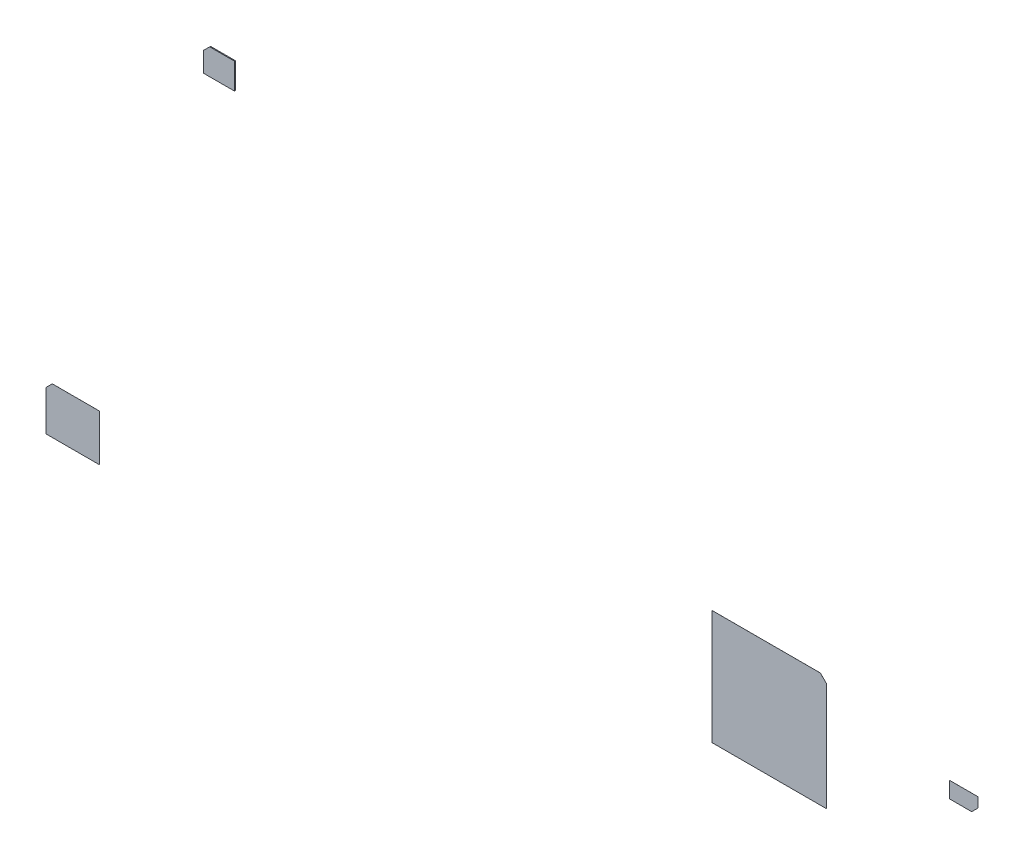
ISO-10303-21;
HEADER;
FILE_DESCRIPTION(('STEP AP214'),'2;1');
FILE_NAME('part.step','',(''),(''),'','','');
FILE_SCHEMA(('AUTOMOTIVE_DESIGN { 1 0 10303 214 1 1 1 1 }'));
ENDSEC;
DATA;
#1=APPLICATION_CONTEXT('core data for automotive mechanical design processes');
#2=APPLICATION_PROTOCOL_DEFINITION('international standard','automotive_design',2000,#1);
#3=PRODUCT_CONTEXT('',#1,'mechanical');
#4=PRODUCT('Part','Part','',(#3));
#5=PRODUCT_RELATED_PRODUCT_CATEGORY('part','',(#4));
#6=PRODUCT_DEFINITION_FORMATION('','',#4);
#7=PRODUCT_DEFINITION_CONTEXT('part definition',#1,'design');
#8=PRODUCT_DEFINITION('design','',#6,#7);
#9=PRODUCT_DEFINITION_SHAPE('','',#8);
#10=(LENGTH_UNIT() NAMED_UNIT(*) SI_UNIT(.MILLI.,.METRE.));
#11=(NAMED_UNIT(*) PLANE_ANGLE_UNIT() SI_UNIT($,.RADIAN.));
#12=(NAMED_UNIT(*) SI_UNIT($,.STERADIAN.) SOLID_ANGLE_UNIT());
#13=UNCERTAINTY_MEASURE_WITH_UNIT(LENGTH_MEASURE(1.E-05),#10,'distance_accuracy_value','');
#14=(GEOMETRIC_REPRESENTATION_CONTEXT(3) GLOBAL_UNCERTAINTY_ASSIGNED_CONTEXT((#13)) GLOBAL_UNIT_ASSIGNED_CONTEXT((#10,
#11,#12)) REPRESENTATION_CONTEXT('',''));
#15=CARTESIAN_POINT('',(0.,0.,0.));
#16=DIRECTION('',(0.,0.,1.));
#17=DIRECTION('',(1.,0.,0.));
#18=AXIS2_PLACEMENT_3D('',#15,#16,#17);
#19=CARTESIAN_POINT('',(-23.5424431925275,-0.652606286569893,1.1503905579871E-06));
#20=DIRECTION('',(0.,-8.74227339409094E-08,1.));
#21=DIRECTION('',(4.37113882867396E-08,1.,8.74227339409093E-08));
#22=AXIS2_PLACEMENT_3D('',#19,#20,#21);
#23=PLANE('',#22);
#24=DIRECTION('',(-4.37113882867396E-08,-1.,-8.74227339409093E-08));
#25=VECTOR('',#24,1.);
#26=CARTESIAN_POINT('',(-23.5424431925275,-0.652606286569893,1.1503905579871E-06));
#27=LINE('',#26,#25);
#28=CARTESIAN_POINT('',(-23.5424431925275,-0.652606286569893,1.1503905579871E-06));
#29=VERTEX_POINT('',#28);
#30=CARTESIAN_POINT('',(-23.542443306177,-3.25260628656988,9.23091450066166E-07));
#31=VERTEX_POINT('',#30);
#32=EDGE_CURVE('P0_E87',#29,#31,#27,.T.);
#33=ORIENTED_EDGE('',*,*,#32,.T.);
#34=DIRECTION('',(-1.,4.37113882867395E-08,0.));
#35=VECTOR('',#34,1.);
#36=CARTESIAN_POINT('',(-23.542443306177,-3.25260628656988,9.23091450066166E-07));
#37=LINE('',#36,#35);
#38=CARTESIAN_POINT('',(-26.542443306177,-3.25260615543571,9.23091461341868E-07));
#39=VERTEX_POINT('',#38);
#40=EDGE_CURVE('P0_E111',#31,#39,#37,.T.);
#41=ORIENTED_EDGE('',*,*,#40,.T.);
#42=DIRECTION('',(4.37113882867396E-08,1.,8.74227339409093E-08));
#43=VECTOR('',#42,1.);
#44=CARTESIAN_POINT('',(-26.542443306177,-3.25260615543571,9.23091461341868E-07));
#45=LINE('',#44,#43);
#46=CARTESIAN_POINT('',(-26.5424432078265,-1.00260615543572,1.11979261280259E-06));
#47=VERTEX_POINT('',#46);
#48=EDGE_CURVE('P0_E119',#39,#47,#45,.T.);
#49=ORIENTED_EDGE('',*,*,#48,.T.);
#50=DIRECTION('',(0.707106812095165,0.707106750277927,6.18172052973683E-08));
#51=VECTOR('',#50,1.);
#52=CARTESIAN_POINT('',(-26.5424432078265,-1.00260615543572,1.11979261280259E-06));
#53=LINE('',#52,#51);
#54=CARTESIAN_POINT('',(-26.1924431925275,-0.652606170734704,1.15039056839544E-06));
#55=VERTEX_POINT('',#54);
#56=EDGE_CURVE('P0_E79',#47,#55,#53,.T.);
#57=ORIENTED_EDGE('',*,*,#56,.T.);
#58=DIRECTION('',(1.,-4.37113882867395E-08,0.));
#59=VECTOR('',#58,1.);
#60=CARTESIAN_POINT('',(-26.1924431925275,-0.652606170734704,1.15039056839544E-06));
#61=LINE('',#60,#59);
#62=EDGE_CURVE('P0_E11',#55,#29,#61,.T.);
#63=ORIENTED_EDGE('',*,*,#62,.T.);
#64=EDGE_LOOP('',(#33,#41,#49,#57,#63));
#65=FACE_BOUND('',#64,.T.);
#66=ADVANCED_FACE('P0_F17',(#65),#23,.F.);
#67=CARTESIAN_POINT('',(-23.5424431925275,-0.652606286657309,0.00100115039055812));
#68=DIRECTION('',(0.,-8.74227339409094E-08,1.));
#69=DIRECTION('',(4.37113882867396E-08,1.,8.74227339409093E-08));
#70=AXIS2_PLACEMENT_3D('',#67,#68,#69);
#71=PLANE('',#70);
#72=DIRECTION('',(1.,-4.37113882867395E-08,0.));
#73=VECTOR('',#72,1.);
#74=CARTESIAN_POINT('',(-26.1924431925275,-0.652606170822134,0.00100115039056809));
#75=LINE('',#74,#73);
#76=CARTESIAN_POINT('',(-26.1924431925275,-0.652606170822134,0.00100115039056809));
#77=VERTEX_POINT('',#76);
#78=CARTESIAN_POINT('',(-23.5424431925275,-0.652606286657309,0.00100115039055812));
#79=VERTEX_POINT('',#78);
#80=EDGE_CURVE('P0_E27',#77,#79,#75,.T.);
#81=ORIENTED_EDGE('',*,*,#80,.F.);
#82=DIRECTION('',(0.707106812095165,0.707106750277927,6.18172052973683E-08));
#83=VECTOR('',#82,1.);
#84=CARTESIAN_POINT('',(-26.5424432078265,-1.00260615552314,0.0010011197926125));
#85=LINE('',#84,#83);
#86=CARTESIAN_POINT('',(-26.5424432078265,-1.00260615552314,0.0010011197926125));
#87=VERTEX_POINT('',#86);
#88=EDGE_CURVE('P0_E123',#87,#77,#85,.T.);
#89=ORIENTED_EDGE('',*,*,#88,.F.);
#90=DIRECTION('',(4.37113882867396E-08,1.,8.74227339409093E-08));
#91=VECTOR('',#90,1.);
#92=CARTESIAN_POINT('',(-26.542443306177,-3.25260615552314,0.00100092309146147));
#93=LINE('',#92,#91);
#94=CARTESIAN_POINT('',(-26.542443306177,-3.25260615552314,0.00100092309146147));
#95=VERTEX_POINT('',#94);
#96=EDGE_CURVE('P0_E115',#95,#87,#93,.T.);
#97=ORIENTED_EDGE('',*,*,#96,.F.);
#98=DIRECTION('',(-1.,4.37113882867395E-08,0.));
#99=VECTOR('',#98,1.);
#100=CARTESIAN_POINT('',(-23.542443306177,-3.2526062866573,0.00100092309144976));
#101=LINE('',#100,#99);
#102=CARTESIAN_POINT('',(-23.542443306177,-3.2526062866573,0.00100092309144976));
#103=VERTEX_POINT('',#102);
#104=EDGE_CURVE('P0_E89',#103,#95,#101,.T.);
#105=ORIENTED_EDGE('',*,*,#104,.F.);
#106=DIRECTION('',(-4.37113882867396E-08,-1.,-8.74227339409093E-08));
#107=VECTOR('',#106,1.);
#108=CARTESIAN_POINT('',(-23.5424431925275,-0.652606286657309,0.00100115039055812));
#109=LINE('',#108,#107);
#110=EDGE_CURVE('P0_E85',#79,#103,#109,.T.);
#111=ORIENTED_EDGE('',*,*,#110,.F.);
#112=EDGE_LOOP('',(#81,#89,#97,#105,#111));
#113=FACE_BOUND('',#112,.T.);
#114=ADVANCED_FACE('P0_F91',(#113),#71,.T.);
#115=CARTESIAN_POINT('',(-26.1924431925275,-0.652606170822134,0.00100115039056809));
#116=DIRECTION('',(-4.37113882867396E-08,-1.,-8.74227339409093E-08));
#117=DIRECTION('',(1.,-4.37113882867395E-08,0.));
#118=AXIS2_PLACEMENT_3D('',#115,#116,#117);
#119=PLANE('',#118);
#120=ORIENTED_EDGE('',*,*,#80,.T.);
#121=DIRECTION('',(0.,8.74227339409094E-08,-1.));
#122=VECTOR('',#121,1.);
#123=CARTESIAN_POINT('',(-23.5424431925275,-0.652606286657309,0.00100115039055812));
#124=LINE('',#123,#122);
#125=EDGE_CURVE('P0_E71',#79,#29,#124,.T.);
#126=ORIENTED_EDGE('',*,*,#125,.T.);
#127=ORIENTED_EDGE('',*,*,#62,.F.);
#128=DIRECTION('',(0.,8.74227339409094E-08,-1.));
#129=VECTOR('',#128,1.);
#130=CARTESIAN_POINT('',(-26.1924431925275,-0.652606170822134,0.00100115039056809));
#131=LINE('',#130,#129);
#132=EDGE_CURVE('P0_E74',#77,#55,#131,.T.);
#133=ORIENTED_EDGE('',*,*,#132,.F.);
#134=EDGE_LOOP('',(#120,#126,#127,#133));
#135=FACE_BOUND('',#134,.T.);
#136=ADVANCED_FACE('P0_F70',(#135),#119,.F.);
#137=CARTESIAN_POINT('',(-26.5424432078265,-1.00260615552314,0.0010011197926125));
#138=DIRECTION('',(0.707106750277927,-0.707106812095165,-6.18172107016005E-08));
#139=DIRECTION('',(0.707106812095165,0.707106750277927,6.18172052973683E-08));
#140=AXIS2_PLACEMENT_3D('',#137,#138,#139);
#141=PLANE('',#140);
#142=ORIENTED_EDGE('',*,*,#88,.T.);
#143=ORIENTED_EDGE('',*,*,#132,.T.);
#144=ORIENTED_EDGE('',*,*,#56,.F.);
#145=DIRECTION('',(0.,8.74227339409094E-08,-1.));
#146=VECTOR('',#145,1.);
#147=CARTESIAN_POINT('',(-26.5424432078265,-1.00260615552314,0.0010011197926125));
#148=LINE('',#147,#146);
#149=EDGE_CURVE('P0_E124',#87,#47,#148,.T.);
#150=ORIENTED_EDGE('',*,*,#149,.F.);
#151=EDGE_LOOP('',(#142,#143,#144,#150));
#152=FACE_BOUND('',#151,.T.);
#153=ADVANCED_FACE('P0_F172',(#152),#141,.F.);
#154=CARTESIAN_POINT('',(-26.542443306177,-3.25260615552314,0.00100092309146147));
#155=DIRECTION('',(1.,-4.37113882867395E-08,0.));
#156=DIRECTION('',(4.37113882867396E-08,1.,8.74227339409093E-08));
#157=AXIS2_PLACEMENT_3D('',#154,#155,#156);
#158=PLANE('',#157);
#159=ORIENTED_EDGE('',*,*,#96,.T.);
#160=ORIENTED_EDGE('',*,*,#149,.T.);
#161=ORIENTED_EDGE('',*,*,#48,.F.);
#162=DIRECTION('',(0.,8.74227339409094E-08,-1.));
#163=VECTOR('',#162,1.);
#164=CARTESIAN_POINT('',(-26.542443306177,-3.25260615552314,0.00100092309146147));
#165=LINE('',#164,#163);
#166=EDGE_CURVE('P0_E116',#95,#39,#165,.T.);
#167=ORIENTED_EDGE('',*,*,#166,.F.);
#168=EDGE_LOOP('',(#159,#160,#161,#167));
#169=FACE_BOUND('',#168,.T.);
#170=ADVANCED_FACE('P0_F171',(#169),#158,.F.);
#171=CARTESIAN_POINT('',(-23.542443306177,-3.2526062866573,0.00100092309144976));
#172=DIRECTION('',(4.37113882867396E-08,1.,8.74227339409093E-08));
#173=DIRECTION('',(-1.,4.37113882867395E-08,0.));
#174=AXIS2_PLACEMENT_3D('',#171,#172,#173);
#175=PLANE('',#174);
#176=ORIENTED_EDGE('',*,*,#104,.T.);
#177=ORIENTED_EDGE('',*,*,#166,.T.);
#178=ORIENTED_EDGE('',*,*,#40,.F.);
#179=DIRECTION('',(0.,8.74227339409094E-08,-1.));
#180=VECTOR('',#179,1.);
#181=CARTESIAN_POINT('',(-23.542443306177,-3.2526062866573,0.00100092309144976));
#182=LINE('',#181,#180);
#183=EDGE_CURVE('P0_E95',#103,#31,#182,.T.);
#184=ORIENTED_EDGE('',*,*,#183,.F.);
#185=EDGE_LOOP('',(#176,#177,#178,#184));
#186=FACE_BOUND('',#185,.T.);
#187=ADVANCED_FACE('P0_F173',(#186),#175,.F.);
#188=CARTESIAN_POINT('',(-23.5424431925275,-0.652606286657309,0.00100115039055812));
#189=DIRECTION('',(-1.,4.37113882867395E-08,0.));
#190=DIRECTION('',(-4.37113882867396E-08,-1.,-8.74227339409093E-08));
#191=AXIS2_PLACEMENT_3D('',#188,#189,#190);
#192=PLANE('',#191);
#193=ORIENTED_EDGE('',*,*,#110,.T.);
#194=ORIENTED_EDGE('',*,*,#183,.T.);
#195=ORIENTED_EDGE('',*,*,#32,.F.);
#196=ORIENTED_EDGE('',*,*,#125,.F.);
#197=EDGE_LOOP('',(#193,#194,#195,#196));
#198=FACE_BOUND('',#197,.T.);
#199=ADVANCED_FACE('P0_F83',(#198),#192,.F.);
#200=CLOSED_SHELL('',(#66,#114,#136,#153,#170,#187,#199));
#201=MANIFOLD_SOLID_BREP('P0_B1',#200);
#202=CARTESIAN_POINT('',(-16.0071981615115,20.0559707106793,-0.0499988998775109));
#203=DIRECTION('',(0.,-8.74227339409094E-08,1.));
#204=DIRECTION('',(4.37113882867396E-08,1.,8.74227339409093E-08));
#205=AXIS2_PLACEMENT_3D('',#202,#203,#204);
#206=PLANE('',#205);
#207=DIRECTION('',(-4.37113882867396E-08,-1.,-8.74227339409093E-08));
#208=VECTOR('',#207,1.);
#209=CARTESIAN_POINT('',(-16.0071981615115,20.0559707106793,-0.0499988998775109));
#210=LINE('',#209,#208);
#211=CARTESIAN_POINT('',(-16.0071981615115,20.0559707106793,-0.0499988998775109));
#212=VERTEX_POINT('',#211);
#213=CARTESIAN_POINT('',(-16.0071982248931,18.6059707106793,-0.0499990266404752));
#214=VERTEX_POINT('',#213);
#215=EDGE_CURVE('P1_E97',#212,#214,#210,.T.);
#216=ORIENTED_EDGE('',*,*,#215,.T.);
#217=DIRECTION('',(-1.,4.37113882867395E-08,0.));
#218=VECTOR('',#217,1.);
#219=CARTESIAN_POINT('',(-16.0071982248931,18.6059707106793,-0.0499990266404752));
#220=LINE('',#219,#218);
#221=CARTESIAN_POINT('',(-17.7471982248931,18.6059707867372,-0.0499990266404687));
#222=VERTEX_POINT('',#221);
#223=EDGE_CURVE('P1_E92',#214,#222,#220,.T.);
#224=ORIENTED_EDGE('',*,*,#223,.T.);
#225=DIRECTION('',(4.37113882867396E-08,1.,8.74227339409093E-08));
#226=VECTOR('',#225,1.);
#227=CARTESIAN_POINT('',(-17.7471982248931,18.6059707867372,-0.0499990266404687));
#228=LINE('',#227,#226);
#229=CARTESIAN_POINT('',(-17.7471981768105,19.7059707867371,-0.0499989304754613));
#230=VERTEX_POINT('',#229);
#231=EDGE_CURVE('P1_E118',#222,#230,#228,.T.);
#232=ORIENTED_EDGE('',*,*,#231,.T.);
#233=DIRECTION('',(0.707106812095165,0.707106750277927,6.18172052973683E-08));
#234=VECTOR('',#233,1.);
#235=CARTESIAN_POINT('',(-17.7471981768105,19.7059707867371,-0.0499989304754613));
#236=LINE('',#235,#234);
#237=CARTESIAN_POINT('',(-17.3971981615116,20.0559707714382,-0.0499988998775057));
#238=VERTEX_POINT('',#237);
#239=EDGE_CURVE('P1_E126',#230,#238,#236,.T.);
#240=ORIENTED_EDGE('',*,*,#239,.T.);
#241=DIRECTION('',(1.,-4.37113882867395E-08,0.));
#242=VECTOR('',#241,1.);
#243=CARTESIAN_POINT('',(-17.3971981615116,20.0559707714382,-0.0499988998775057));
#244=LINE('',#243,#242);
#245=EDGE_CURVE('P1_E11',#238,#212,#244,.T.);
#246=ORIENTED_EDGE('',*,*,#245,.T.);
#247=EDGE_LOOP('',(#216,#224,#232,#240,#246));
#248=FACE_BOUND('',#247,.T.);
#249=ADVANCED_FACE('P1_F17',(#248),#206,.F.);
#250=CARTESIAN_POINT('',(-16.0071981615115,20.0559707063082,1.10012248876606E-06));
#251=DIRECTION('',(0.,-8.74227339409094E-08,1.));
#252=DIRECTION('',(4.37113882867396E-08,1.,8.74227339409093E-08));
#253=AXIS2_PLACEMENT_3D('',#250,#251,#252);
#254=PLANE('',#253);
#255=DIRECTION('',(1.,-4.37113882867395E-08,0.));
#256=VECTOR('',#255,1.);
#257=CARTESIAN_POINT('',(-17.3971981615116,20.055970767067,1.10012249397023E-06));
#258=LINE('',#257,#256);
#259=CARTESIAN_POINT('',(-17.3971981615116,20.055970767067,1.10012249397023E-06));
#260=VERTEX_POINT('',#259);
#261=CARTESIAN_POINT('',(-16.0071981615115,20.0559707063082,1.10012248876606E-06));
#262=VERTEX_POINT('',#261);
#263=EDGE_CURVE('P1_E26',#260,#262,#258,.T.);
#264=ORIENTED_EDGE('',*,*,#263,.F.);
#265=DIRECTION('',(0.707106812095165,0.707106750277927,6.18172052973683E-08));
#266=VECTOR('',#265,1.);
#267=CARTESIAN_POINT('',(-17.7471981768105,19.705970782366,1.06952453837739E-06));
#268=LINE('',#267,#266);
#269=CARTESIAN_POINT('',(-17.7471981768105,19.705970782366,1.06952453837739E-06));
#270=VERTEX_POINT('',#269);
#271=EDGE_CURVE('P1_E122',#270,#260,#268,.T.);
#272=ORIENTED_EDGE('',*,*,#271,.F.);
#273=DIRECTION('',(4.37113882867396E-08,1.,8.74227339409093E-08));
#274=VECTOR('',#273,1.);
#275=CARTESIAN_POINT('',(-17.7471982248931,18.6059707823661,9.73359530996587E-07));
#276=LINE('',#275,#274);
#277=CARTESIAN_POINT('',(-17.7471982248931,18.6059707823661,9.73359530996587E-07));
#278=VERTEX_POINT('',#277);
#279=EDGE_CURVE('P1_E80',#278,#270,#276,.T.);
#280=ORIENTED_EDGE('',*,*,#279,.F.);
#281=DIRECTION('',(-1.,4.37113882867395E-08,0.));
#282=VECTOR('',#281,1.);
#283=CARTESIAN_POINT('',(-16.0071982248931,18.6059707063082,9.73359524491374E-07));
#284=LINE('',#283,#282);
#285=CARTESIAN_POINT('',(-16.0071982248931,18.6059707063082,9.73359524491374E-07));
#286=VERTEX_POINT('',#285);
#287=EDGE_CURVE('P1_E74',#286,#278,#284,.T.);
#288=ORIENTED_EDGE('',*,*,#287,.F.);
#289=DIRECTION('',(-4.37113882867396E-08,-1.,-8.74227339409093E-08));
#290=VECTOR('',#289,1.);
#291=CARTESIAN_POINT('',(-16.0071981615115,20.0559707063082,1.10012248876606E-06));
#292=LINE('',#291,#290);
#293=EDGE_CURVE('P1_E78',#262,#286,#292,.T.);
#294=ORIENTED_EDGE('',*,*,#293,.F.);
#295=EDGE_LOOP('',(#264,#272,#280,#288,#294));
#296=FACE_BOUND('',#295,.T.);
#297=ADVANCED_FACE('P1_F76',(#296),#254,.T.);
#298=CARTESIAN_POINT('',(-17.3971981615116,20.055970767067,1.10012249397023E-06));
#299=DIRECTION('',(-4.37113882867396E-08,-1.,-8.74227339409093E-08));
#300=DIRECTION('',(1.,-4.37113882867395E-08,0.));
#301=AXIS2_PLACEMENT_3D('',#298,#299,#300);
#302=PLANE('',#301);
#303=ORIENTED_EDGE('',*,*,#263,.T.);
#304=DIRECTION('',(0.,8.74227339409094E-08,-1.));
#305=VECTOR('',#304,1.);
#306=CARTESIAN_POINT('',(-16.0071981615115,20.0559707063082,1.10012248876606E-06));
#307=LINE('',#306,#305);
#308=EDGE_CURVE('P1_E86',#262,#212,#307,.T.);
#309=ORIENTED_EDGE('',*,*,#308,.T.);
#310=ORIENTED_EDGE('',*,*,#245,.F.);
#311=DIRECTION('',(0.,8.74227339409094E-08,-1.));
#312=VECTOR('',#311,1.);
#313=CARTESIAN_POINT('',(-17.3971981615116,20.055970767067,1.10012249397023E-06));
#314=LINE('',#313,#312);
#315=EDGE_CURVE('P1_E129',#260,#238,#314,.T.);
#316=ORIENTED_EDGE('',*,*,#315,.F.);
#317=EDGE_LOOP('',(#303,#309,#310,#316));
#318=FACE_BOUND('',#317,.T.);
#319=ADVANCED_FACE('P1_F170',(#318),#302,.F.);
#320=CARTESIAN_POINT('',(-17.7471981768105,19.705970782366,1.06952453837739E-06));
#321=DIRECTION('',(0.707106750277927,-0.707106812095165,-6.18172107016005E-08));
#322=DIRECTION('',(0.707106812095165,0.707106750277927,6.18172052973683E-08));
#323=AXIS2_PLACEMENT_3D('',#320,#321,#322);
#324=PLANE('',#323);
#325=ORIENTED_EDGE('',*,*,#271,.T.);
#326=ORIENTED_EDGE('',*,*,#315,.T.);
#327=ORIENTED_EDGE('',*,*,#239,.F.);
#328=DIRECTION('',(0.,8.74227339409094E-08,-1.));
#329=VECTOR('',#328,1.);
#330=CARTESIAN_POINT('',(-17.7471981768105,19.705970782366,1.06952453837739E-06));
#331=LINE('',#330,#329);
#332=EDGE_CURVE('P1_E123',#270,#230,#331,.T.);
#333=ORIENTED_EDGE('',*,*,#332,.F.);
#334=EDGE_LOOP('',(#325,#326,#327,#333));
#335=FACE_BOUND('',#334,.T.);
#336=ADVANCED_FACE('P1_F181',(#335),#324,.F.);
#337=CARTESIAN_POINT('',(-17.7471982248931,18.6059707823661,9.73359530996587E-07));
#338=DIRECTION('',(1.,-4.37113882867395E-08,0.));
#339=DIRECTION('',(4.37113882867396E-08,1.,8.74227339409093E-08));
#340=AXIS2_PLACEMENT_3D('',#337,#338,#339);
#341=PLANE('',#340);
#342=ORIENTED_EDGE('',*,*,#279,.T.);
#343=ORIENTED_EDGE('',*,*,#332,.T.);
#344=ORIENTED_EDGE('',*,*,#231,.F.);
#345=DIRECTION('',(0.,8.74227339409094E-08,-1.));
#346=VECTOR('',#345,1.);
#347=CARTESIAN_POINT('',(-17.7471982248931,18.6059707823661,9.73359530996587E-07));
#348=LINE('',#347,#346);
#349=EDGE_CURVE('P1_E85',#278,#222,#348,.T.);
#350=ORIENTED_EDGE('',*,*,#349,.F.);
#351=EDGE_LOOP('',(#342,#343,#344,#350));
#352=FACE_BOUND('',#351,.T.);
#353=ADVANCED_FACE('P1_F179',(#352),#341,.F.);
#354=CARTESIAN_POINT('',(-16.0071982248931,18.6059707063082,9.73359524491374E-07));
#355=DIRECTION('',(4.37113882867396E-08,1.,8.74227339409093E-08));
#356=DIRECTION('',(-1.,4.37113882867395E-08,0.));
#357=AXIS2_PLACEMENT_3D('',#354,#355,#356);
#358=PLANE('',#357);
#359=ORIENTED_EDGE('',*,*,#287,.T.);
#360=ORIENTED_EDGE('',*,*,#349,.T.);
#361=ORIENTED_EDGE('',*,*,#223,.F.);
#362=DIRECTION('',(0.,8.74227339409094E-08,-1.));
#363=VECTOR('',#362,1.);
#364=CARTESIAN_POINT('',(-16.0071982248931,18.6059707063082,9.73359524491374E-07));
#365=LINE('',#364,#363);
#366=EDGE_CURVE('P1_E89',#286,#214,#365,.T.);
#367=ORIENTED_EDGE('',*,*,#366,.F.);
#368=EDGE_LOOP('',(#359,#360,#361,#367));
#369=FACE_BOUND('',#368,.T.);
#370=ADVANCED_FACE('P1_F90',(#369),#358,.F.);
#371=CARTESIAN_POINT('',(-16.0071981615115,20.0559707063082,1.10012248876606E-06));
#372=DIRECTION('',(-1.,4.37113882867395E-08,0.));
#373=DIRECTION('',(-4.37113882867396E-08,-1.,-8.74227339409093E-08));
#374=AXIS2_PLACEMENT_3D('',#371,#372,#373);
#375=PLANE('',#374);
#376=ORIENTED_EDGE('',*,*,#293,.T.);
#377=ORIENTED_EDGE('',*,*,#366,.T.);
#378=ORIENTED_EDGE('',*,*,#215,.F.);
#379=ORIENTED_EDGE('',*,*,#308,.F.);
#380=EDGE_LOOP('',(#376,#377,#378,#379));
#381=FACE_BOUND('',#380,.T.);
#382=ADVANCED_FACE('P1_F100',(#381),#375,.F.);
#383=CLOSED_SHELL('',(#249,#297,#319,#336,#353,#370,#382));
#384=MANIFOLD_SOLID_BREP('P1_B1',#383);
#385=CARTESIAN_POINT('',(17.0861605968744,0.415760503644086,7.56988240754181E-07));
#386=DIRECTION('',(0.,-8.74227339409092E-08,1.));
#387=DIRECTION('',(1.,-8.74227765734792E-08,0.));
#388=AXIS2_PLACEMENT_3D('',#385,#386,#387);
#389=PLANE('',#388);
#390=DIRECTION('',(-1.,8.74227765734792E-08,0.));
#391=VECTOR('',#390,1.);
#392=CARTESIAN_POINT('',(17.0861605968744,0.415760503644086,7.56988240754181E-07));
#393=LINE('',#392,#391);
#394=CARTESIAN_POINT('',(17.0861605968744,0.415760503644086,7.56988240754181E-07));
#395=VERTEX_POINT('',#394);
#396=CARTESIAN_POINT('',(10.6861605968744,0.415761063149861,7.56988289760119E-07));
#397=VERTEX_POINT('',#396);
#398=EDGE_CURVE('P2_E87',#395,#397,#393,.T.);
#399=ORIENTED_EDGE('',*,*,#398,.T.);
#400=DIRECTION('',(8.74227765734795E-08,1.,8.74227339409088E-08));
#401=VECTOR('',#400,1.);
#402=CARTESIAN_POINT('',(10.6861605968744,0.415761063149861,7.56988289760119E-07));
#403=LINE('',#402,#401);
#404=CARTESIAN_POINT('',(10.6861611563802,6.81576106314982,1.31649378681473E-06));
#405=VERTEX_POINT('',#404);
#406=EDGE_CURVE('P2_E111',#397,#405,#403,.T.);
#407=ORIENTED_EDGE('',*,*,#406,.T.);
#408=DIRECTION('',(1.,-8.74227765734792E-08,0.));
#409=VECTOR('',#408,1.);
#410=CARTESIAN_POINT('',(10.6861611563802,6.81576106314982,1.31649378681473E-06));
#411=LINE('',#410,#409);
#412=CARTESIAN_POINT('',(16.7361611563802,6.81576053424202,1.31649374084455E-06));
#413=VERTEX_POINT('',#412);
#414=EDGE_CURVE('P2_E119',#405,#413,#411,.T.);
#415=ORIENTED_EDGE('',*,*,#414,.T.);
#416=DIRECTION('',(0.707106719369306,-0.707106843003783,-6.18172134037162E-08));
#417=VECTOR('',#416,1.);
#418=CARTESIAN_POINT('',(16.7361611563802,6.81576053424202,1.31649374084455E-06));
#419=LINE('',#418,#417);
#420=CARTESIAN_POINT('',(17.0861611257822,6.46576050364406,1.28589578134858E-06));
#421=VERTEX_POINT('',#420);
#422=EDGE_CURVE('P2_E79',#413,#421,#419,.T.);
#423=ORIENTED_EDGE('',*,*,#422,.T.);
#424=DIRECTION('',(-8.74227765734795E-08,-1.,-8.74227339409088E-08));
#425=VECTOR('',#424,1.);
#426=CARTESIAN_POINT('',(17.0861611257822,6.46576050364406,1.28589578134858E-06));
#427=LINE('',#426,#425);
#428=EDGE_CURVE('P2_E11',#421,#395,#427,.T.);
#429=ORIENTED_EDGE('',*,*,#428,.T.);
#430=EDGE_LOOP('',(#399,#407,#415,#423,#429));
#431=FACE_BOUND('',#430,.T.);
#432=ADVANCED_FACE('P2_F17',(#431),#389,.F.);
#433=CARTESIAN_POINT('',(17.0861605968744,0.415760503556656,0.00100075698824089));
#434=DIRECTION('',(0.,-8.74227339409092E-08,1.));
#435=DIRECTION('',(1.,-8.74227765734792E-08,0.));
#436=AXIS2_PLACEMENT_3D('',#433,#434,#435);
#437=PLANE('',#436);
#438=DIRECTION('',(-8.74227765734795E-08,-1.,-8.74227339409088E-08));
#439=VECTOR('',#438,1.);
#440=CARTESIAN_POINT('',(17.0861611257822,6.46576050355663,0.00100128589578105));
#441=LINE('',#440,#439);
#442=CARTESIAN_POINT('',(17.0861611257822,6.46576050355663,0.00100128589578105));
#443=VERTEX_POINT('',#442);
#444=CARTESIAN_POINT('',(17.0861605968744,0.415760503556656,0.00100075698824089));
#445=VERTEX_POINT('',#444);
#446=EDGE_CURVE('P2_E27',#443,#445,#441,.T.);
#447=ORIENTED_EDGE('',*,*,#446,.F.);
#448=DIRECTION('',(0.707106719369306,-0.707106843003783,-6.18172134037162E-08));
#449=VECTOR('',#448,1.);
#450=CARTESIAN_POINT('',(16.7361611563802,6.81576053415459,0.00100131649374098));
#451=LINE('',#450,#449);
#452=CARTESIAN_POINT('',(16.7361611563802,6.81576053415459,0.00100131649374098));
#453=VERTEX_POINT('',#452);
#454=EDGE_CURVE('P2_E123',#453,#443,#451,.T.);
#455=ORIENTED_EDGE('',*,*,#454,.F.);
#456=DIRECTION('',(1.,-8.74227765734792E-08,0.));
#457=VECTOR('',#456,1.);
#458=CARTESIAN_POINT('',(10.6861611563802,6.81576106306239,0.00100131649378695));
#459=LINE('',#458,#457);
#460=CARTESIAN_POINT('',(10.6861611563802,6.81576106306239,0.00100131649378695));
#461=VERTEX_POINT('',#460);
#462=EDGE_CURVE('P2_E115',#461,#453,#459,.T.);
#463=ORIENTED_EDGE('',*,*,#462,.F.);
#464=DIRECTION('',(8.74227765734795E-08,1.,8.74227339409088E-08));
#465=VECTOR('',#464,1.);
#466=CARTESIAN_POINT('',(10.6861605968744,0.415761063062431,0.00100075698828989));
#467=LINE('',#466,#465);
#468=CARTESIAN_POINT('',(10.6861605968744,0.415761063062431,0.00100075698828989));
#469=VERTEX_POINT('',#468);
#470=EDGE_CURVE('P2_E89',#469,#461,#467,.T.);
#471=ORIENTED_EDGE('',*,*,#470,.F.);
#472=DIRECTION('',(-1.,8.74227765734792E-08,0.));
#473=VECTOR('',#472,1.);
#474=CARTESIAN_POINT('',(17.0861605968744,0.415760503556656,0.00100075698824089));
#475=LINE('',#474,#473);
#476=EDGE_CURVE('P2_E85',#445,#469,#475,.T.);
#477=ORIENTED_EDGE('',*,*,#476,.F.);
#478=EDGE_LOOP('',(#447,#455,#463,#471,#477));
#479=FACE_BOUND('',#478,.T.);
#480=ADVANCED_FACE('P2_F91',(#479),#437,.T.);
#481=CARTESIAN_POINT('',(17.0861611257822,6.46576050355663,0.00100128589578105));
#482=DIRECTION('',(-1.,8.74227765734792E-08,0.));
#483=DIRECTION('',(-8.74227765734795E-08,-1.,-8.74227339409088E-08));
#484=AXIS2_PLACEMENT_3D('',#481,#482,#483);
#485=PLANE('',#484);
#486=ORIENTED_EDGE('',*,*,#446,.T.);
#487=DIRECTION('',(0.,8.74227339409092E-08,-1.));
#488=VECTOR('',#487,1.);
#489=CARTESIAN_POINT('',(17.0861605968744,0.415760503556656,0.00100075698824089));
#490=LINE('',#489,#488);
#491=EDGE_CURVE('P2_E71',#445,#395,#490,.T.);
#492=ORIENTED_EDGE('',*,*,#491,.T.);
#493=ORIENTED_EDGE('',*,*,#428,.F.);
#494=DIRECTION('',(0.,8.74227339409092E-08,-1.));
#495=VECTOR('',#494,1.);
#496=CARTESIAN_POINT('',(17.0861611257822,6.46576050355663,0.00100128589578105));
#497=LINE('',#496,#495);
#498=EDGE_CURVE('P2_E74',#443,#421,#497,.T.);
#499=ORIENTED_EDGE('',*,*,#498,.F.);
#500=EDGE_LOOP('',(#486,#492,#493,#499));
#501=FACE_BOUND('',#500,.T.);
#502=ADVANCED_FACE('P2_F70',(#501),#485,.F.);
#503=CARTESIAN_POINT('',(16.7361611563802,6.81576053415459,0.00100131649374098));
#504=DIRECTION('',(-0.707106843003783,-0.707106719369306,-6.18172025952518E-08));
#505=DIRECTION('',(0.707106719369306,-0.707106843003783,-6.18172134037162E-08));
#506=AXIS2_PLACEMENT_3D('',#503,#504,#505);
#507=PLANE('',#506);
#508=ORIENTED_EDGE('',*,*,#454,.T.);
#509=ORIENTED_EDGE('',*,*,#498,.T.);
#510=ORIENTED_EDGE('',*,*,#422,.F.);
#511=DIRECTION('',(0.,8.74227339409092E-08,-1.));
#512=VECTOR('',#511,1.);
#513=CARTESIAN_POINT('',(16.7361611563802,6.81576053415459,0.00100131649374098));
#514=LINE('',#513,#512);
#515=EDGE_CURVE('P2_E124',#453,#413,#514,.T.);
#516=ORIENTED_EDGE('',*,*,#515,.F.);
#517=EDGE_LOOP('',(#508,#509,#510,#516));
#518=FACE_BOUND('',#517,.T.);
#519=ADVANCED_FACE('P2_F172',(#518),#507,.F.);
#520=CARTESIAN_POINT('',(10.6861611563802,6.81576106306239,0.00100131649378695));
#521=DIRECTION('',(-8.74227765734795E-08,-1.,-8.74227339409088E-08));
#522=DIRECTION('',(1.,-8.74227765734792E-08,0.));
#523=AXIS2_PLACEMENT_3D('',#520,#521,#522);
#524=PLANE('',#523);
#525=ORIENTED_EDGE('',*,*,#462,.T.);
#526=ORIENTED_EDGE('',*,*,#515,.T.);
#527=ORIENTED_EDGE('',*,*,#414,.F.);
#528=DIRECTION('',(0.,8.74227339409092E-08,-1.));
#529=VECTOR('',#528,1.);
#530=CARTESIAN_POINT('',(10.6861611563802,6.81576106306239,0.00100131649378695));
#531=LINE('',#530,#529);
#532=EDGE_CURVE('P2_E116',#461,#405,#531,.T.);
#533=ORIENTED_EDGE('',*,*,#532,.F.);
#534=EDGE_LOOP('',(#525,#526,#527,#533));
#535=FACE_BOUND('',#534,.T.);
#536=ADVANCED_FACE('P2_F171',(#535),#524,.F.);
#537=CARTESIAN_POINT('',(10.6861605968744,0.415761063062431,0.00100075698828989));
#538=DIRECTION('',(1.,-8.74227765734792E-08,0.));
#539=DIRECTION('',(8.74227765734795E-08,1.,8.74227339409088E-08));
#540=AXIS2_PLACEMENT_3D('',#537,#538,#539);
#541=PLANE('',#540);
#542=ORIENTED_EDGE('',*,*,#470,.T.);
#543=ORIENTED_EDGE('',*,*,#532,.T.);
#544=ORIENTED_EDGE('',*,*,#406,.F.);
#545=DIRECTION('',(0.,8.74227339409092E-08,-1.));
#546=VECTOR('',#545,1.);
#547=CARTESIAN_POINT('',(10.6861605968744,0.415761063062431,0.00100075698828989));
#548=LINE('',#547,#546);
#549=EDGE_CURVE('P2_E95',#469,#397,#548,.T.);
#550=ORIENTED_EDGE('',*,*,#549,.F.);
#551=EDGE_LOOP('',(#542,#543,#544,#550));
#552=FACE_BOUND('',#551,.T.);
#553=ADVANCED_FACE('P2_F173',(#552),#541,.F.);
#554=CARTESIAN_POINT('',(17.0861605968744,0.415760503556656,0.00100075698824089));
#555=DIRECTION('',(8.74227765734795E-08,1.,8.74227339409088E-08));
#556=DIRECTION('',(-1.,8.74227765734792E-08,0.));
#557=AXIS2_PLACEMENT_3D('',#554,#555,#556);
#558=PLANE('',#557);
#559=ORIENTED_EDGE('',*,*,#476,.T.);
#560=ORIENTED_EDGE('',*,*,#549,.T.);
#561=ORIENTED_EDGE('',*,*,#398,.F.);
#562=ORIENTED_EDGE('',*,*,#491,.F.);
#563=EDGE_LOOP('',(#559,#560,#561,#562));
#564=FACE_BOUND('',#563,.T.);
#565=ADVANCED_FACE('P2_F83',(#564),#558,.F.);
#566=CLOSED_SHELL('',(#432,#480,#502,#519,#536,#553,#565));
#567=MANIFOLD_SOLID_BREP('P2_B1',#566);
#568=CARTESIAN_POINT('',(23.9471990792714,4.33096770211716,9.9740077958918E-07));
#569=DIRECTION('',(0.,-8.74227339409095E-08,1.));
#570=DIRECTION('',(-1.19248806384999E-08,-1.,-8.74227339409095E-08));
#571=AXIS2_PLACEMENT_3D('',#568,#569,#570);
#572=PLANE('',#571);
#573=DIRECTION('',(1.19248806384999E-08,1.,8.74227339409095E-08));
#574=VECTOR('',#573,1.);
#575=CARTESIAN_POINT('',(23.9471990792714,4.33096770211716,9.9740077958918E-07));
#576=LINE('',#575,#574);
#577=CARTESIAN_POINT('',(23.9471990792714,4.33096770211716,9.9740077958918E-07));
#578=VERTEX_POINT('',#577);
#579=CARTESIAN_POINT('',(23.9471990900038,5.23096770211715,1.07608124017347E-06));
#580=VERTEX_POINT('',#579);
#581=EDGE_CURVE('P3_E87',#578,#580,#576,.T.);
#582=ORIENTED_EDGE('',*,*,#581,.T.);
#583=DIRECTION('',(1.,-1.19248806384999E-08,0.));
#584=VECTOR('',#583,1.);
#585=CARTESIAN_POINT('',(23.9471990900038,5.23096770211715,1.07608124017347E-06));
#586=LINE('',#585,#584);
#587=CARTESIAN_POINT('',(25.5471990900039,5.23096768303735,1.07608123843875E-06));
#588=VERTEX_POINT('',#587);
#589=EDGE_CURVE('P3_E111',#580,#588,#586,.T.);
#590=ORIENTED_EDGE('',*,*,#589,.T.);
#591=DIRECTION('',(-1.19248806384999E-08,-1.,-8.74227339409095E-08));
#592=VECTOR('',#591,1.);
#593=CARTESIAN_POINT('',(25.5471990900039,5.23096768303735,1.07608123843875E-06));
#594=LINE('',#593,#592);
#595=CARTESIAN_POINT('',(25.5471990834452,4.68096768303736,1.02799873474835E-06));
#596=VERTEX_POINT('',#595);
#597=EDGE_CURVE('P3_E119',#588,#596,#594,.T.);
#598=ORIENTED_EDGE('',*,*,#597,.T.);
#599=DIRECTION('',(-0.70710678961871,-0.707106772754382,-6.18172072623216E-08));
#600=VECTOR('',#599,1.);
#601=CARTESIAN_POINT('',(25.5471990834452,4.68096768303736,1.02799873474835E-06));
#602=LINE('',#601,#600);
#603=CARTESIAN_POINT('',(25.1971990792714,4.33096768721105,9.97400778288138E-07));
#604=VERTEX_POINT('',#603);
#605=EDGE_CURVE('P3_E79',#596,#604,#602,.T.);
#606=ORIENTED_EDGE('',*,*,#605,.T.);
#607=DIRECTION('',(-1.,1.19248806384999E-08,0.));
#608=VECTOR('',#607,1.);
#609=CARTESIAN_POINT('',(25.1971990792714,4.33096768721105,9.97400778288138E-07));
#610=LINE('',#609,#608);
#611=EDGE_CURVE('P3_E11',#604,#578,#610,.T.);
#612=ORIENTED_EDGE('',*,*,#611,.T.);
#613=EDGE_LOOP('',(#582,#590,#598,#606,#612));
#614=FACE_BOUND('',#613,.T.);
#615=ADVANCED_FACE('P3_F17',(#614),#572,.F.);
#616=CARTESIAN_POINT('',(23.9471990792714,4.33096770202973,0.00100099740077972));
#617=DIRECTION('',(0.,-8.74227339409095E-08,1.));
#618=DIRECTION('',(-1.19248806384999E-08,-1.,-8.74227339409095E-08));
#619=AXIS2_PLACEMENT_3D('',#616,#617,#618);
#620=PLANE('',#619);
#621=DIRECTION('',(-1.,1.19248806384999E-08,0.));
#622=VECTOR('',#621,1.);
#623=CARTESIAN_POINT('',(25.1971990792714,4.33096768712362,0.00100099740077842));
#624=LINE('',#623,#622);
#625=CARTESIAN_POINT('',(25.1971990792714,4.33096768712362,0.00100099740077842));
#626=VERTEX_POINT('',#625);
#627=CARTESIAN_POINT('',(23.9471990792714,4.33096770202973,0.00100099740077972));
#628=VERTEX_POINT('',#627);
#629=EDGE_CURVE('P3_E27',#626,#628,#624,.T.);
#630=ORIENTED_EDGE('',*,*,#629,.F.);
#631=DIRECTION('',(-0.70710678961871,-0.707106772754382,-6.18172072623216E-08));
#632=VECTOR('',#631,1.);
#633=CARTESIAN_POINT('',(25.5471990834452,4.68096768294993,0.00100102799873488));
#634=LINE('',#633,#632);
#635=CARTESIAN_POINT('',(25.5471990834452,4.68096768294993,0.00100102799873488));
#636=VERTEX_POINT('',#635);
#637=EDGE_CURVE('P3_E123',#636,#626,#634,.T.);
#638=ORIENTED_EDGE('',*,*,#637,.F.);
#639=DIRECTION('',(-1.19248806384999E-08,-1.,-8.74227339409095E-08));
#640=VECTOR('',#639,1.);
#641=CARTESIAN_POINT('',(25.5471990900039,5.23096768294992,0.00100107608123857));
#642=LINE('',#641,#640);
#643=CARTESIAN_POINT('',(25.5471990900039,5.23096768294992,0.00100107608123857));
#644=VERTEX_POINT('',#643);
#645=EDGE_CURVE('P3_E115',#644,#636,#642,.T.);
#646=ORIENTED_EDGE('',*,*,#645,.F.);
#647=DIRECTION('',(1.,-1.19248806384999E-08,0.));
#648=VECTOR('',#647,1.);
#649=CARTESIAN_POINT('',(23.9471990900038,5.23096770202972,0.00100107608124031));
#650=LINE('',#649,#648);
#651=CARTESIAN_POINT('',(23.9471990900038,5.23096770202972,0.00100107608124031));
#652=VERTEX_POINT('',#651);
#653=EDGE_CURVE('P3_E89',#652,#644,#650,.T.);
#654=ORIENTED_EDGE('',*,*,#653,.F.);
#655=DIRECTION('',(1.19248806384999E-08,1.,8.74227339409095E-08));
#656=VECTOR('',#655,1.);
#657=CARTESIAN_POINT('',(23.9471990792714,4.33096770202973,0.00100099740077972));
#658=LINE('',#657,#656);
#659=EDGE_CURVE('P3_E85',#628,#652,#658,.T.);
#660=ORIENTED_EDGE('',*,*,#659,.F.);
#661=EDGE_LOOP('',(#630,#638,#646,#654,#660));
#662=FACE_BOUND('',#661,.T.);
#663=ADVANCED_FACE('P3_F91',(#662),#620,.T.);
#664=CARTESIAN_POINT('',(25.1971990792714,4.33096768712362,0.00100099740077842));
#665=DIRECTION('',(1.19248806384999E-08,1.,8.74227339409095E-08));
#666=DIRECTION('',(-1.,1.19248806384999E-08,0.));
#667=AXIS2_PLACEMENT_3D('',#664,#665,#666);
#668=PLANE('',#667);
#669=ORIENTED_EDGE('',*,*,#629,.T.);
#670=DIRECTION('',(0.,8.74227339409095E-08,-1.));
#671=VECTOR('',#670,1.);
#672=CARTESIAN_POINT('',(23.9471990792714,4.33096770202973,0.00100099740077972));
#673=LINE('',#672,#671);
#674=EDGE_CURVE('P3_E71',#628,#578,#673,.T.);
#675=ORIENTED_EDGE('',*,*,#674,.T.);
#676=ORIENTED_EDGE('',*,*,#611,.F.);
#677=DIRECTION('',(0.,8.74227339409095E-08,-1.));
#678=VECTOR('',#677,1.);
#679=CARTESIAN_POINT('',(25.1971990792714,4.33096768712362,0.00100099740077842));
#680=LINE('',#679,#678);
#681=EDGE_CURVE('P3_E74',#626,#604,#680,.T.);
#682=ORIENTED_EDGE('',*,*,#681,.F.);
#683=EDGE_LOOP('',(#669,#675,#676,#682));
#684=FACE_BOUND('',#683,.T.);
#685=ADVANCED_FACE('P3_F70',(#684),#668,.F.);
#686=CARTESIAN_POINT('',(25.5471990834452,4.68096768294993,0.00100102799873488));
#687=DIRECTION('',(-0.707106772754382,0.70710678961871,6.18172087366473E-08));
#688=DIRECTION('',(-0.70710678961871,-0.707106772754382,-6.18172072623216E-08));
#689=AXIS2_PLACEMENT_3D('',#686,#687,#688);
#690=PLANE('',#689);
#691=ORIENTED_EDGE('',*,*,#637,.T.);
#692=ORIENTED_EDGE('',*,*,#681,.T.);
#693=ORIENTED_EDGE('',*,*,#605,.F.);
#694=DIRECTION('',(0.,8.74227339409095E-08,-1.));
#695=VECTOR('',#694,1.);
#696=CARTESIAN_POINT('',(25.5471990834452,4.68096768294993,0.00100102799873488));
#697=LINE('',#696,#695);
#698=EDGE_CURVE('P3_E124',#636,#596,#697,.T.);
#699=ORIENTED_EDGE('',*,*,#698,.F.);
#700=EDGE_LOOP('',(#691,#692,#693,#699));
#701=FACE_BOUND('',#700,.T.);
#702=ADVANCED_FACE('P3_F172',(#701),#690,.F.);
#703=CARTESIAN_POINT('',(25.5471990900039,5.23096768294992,0.00100107608123857));
#704=DIRECTION('',(-1.,1.19248806384999E-08,0.));
#705=DIRECTION('',(-1.19248806384999E-08,-1.,-8.74227339409095E-08));
#706=AXIS2_PLACEMENT_3D('',#703,#704,#705);
#707=PLANE('',#706);
#708=ORIENTED_EDGE('',*,*,#645,.T.);
#709=ORIENTED_EDGE('',*,*,#698,.T.);
#710=ORIENTED_EDGE('',*,*,#597,.F.);
#711=DIRECTION('',(0.,8.74227339409095E-08,-1.));
#712=VECTOR('',#711,1.);
#713=CARTESIAN_POINT('',(25.5471990900039,5.23096768294992,0.00100107608123857));
#714=LINE('',#713,#712);
#715=EDGE_CURVE('P3_E116',#644,#588,#714,.T.);
#716=ORIENTED_EDGE('',*,*,#715,.F.);
#717=EDGE_LOOP('',(#708,#709,#710,#716));
#718=FACE_BOUND('',#717,.T.);
#719=ADVANCED_FACE('P3_F171',(#718),#707,.F.);
#720=CARTESIAN_POINT('',(23.9471990900038,5.23096770202972,0.00100107608124031));
#721=DIRECTION('',(-1.19248806384999E-08,-1.,-8.74227339409095E-08));
#722=DIRECTION('',(1.,-1.19248806384999E-08,0.));
#723=AXIS2_PLACEMENT_3D('',#720,#721,#722);
#724=PLANE('',#723);
#725=ORIENTED_EDGE('',*,*,#653,.T.);
#726=ORIENTED_EDGE('',*,*,#715,.T.);
#727=ORIENTED_EDGE('',*,*,#589,.F.);
#728=DIRECTION('',(0.,8.74227339409095E-08,-1.));
#729=VECTOR('',#728,1.);
#730=CARTESIAN_POINT('',(23.9471990900038,5.23096770202972,0.00100107608124031));
#731=LINE('',#730,#729);
#732=EDGE_CURVE('P3_E95',#652,#580,#731,.T.);
#733=ORIENTED_EDGE('',*,*,#732,.F.);
#734=EDGE_LOOP('',(#725,#726,#727,#733));
#735=FACE_BOUND('',#734,.T.);
#736=ADVANCED_FACE('P3_F173',(#735),#724,.F.);
#737=CARTESIAN_POINT('',(23.9471990792714,4.33096770202973,0.00100099740077972));
#738=DIRECTION('',(1.,-1.19248806384999E-08,0.));
#739=DIRECTION('',(1.19248806384999E-08,1.,8.74227339409095E-08));
#740=AXIS2_PLACEMENT_3D('',#737,#738,#739);
#741=PLANE('',#740);
#742=ORIENTED_EDGE('',*,*,#659,.T.);
#743=ORIENTED_EDGE('',*,*,#732,.T.);
#744=ORIENTED_EDGE('',*,*,#581,.F.);
#745=ORIENTED_EDGE('',*,*,#674,.F.);
#746=EDGE_LOOP('',(#742,#743,#744,#745));
#747=FACE_BOUND('',#746,.T.);
#748=ADVANCED_FACE('P3_F83',(#747),#741,.F.);
#749=CLOSED_SHELL('',(#615,#663,#685,#702,#719,#736,#748));
#750=MANIFOLD_SOLID_BREP('P3_B1',#749);
#751=ADVANCED_BREP_SHAPE_REPRESENTATION('',(#18,#201,#384,#567,#750),#14);
#752=SHAPE_DEFINITION_REPRESENTATION(#9,#751);
ENDSEC;
END-ISO-10303-21;
